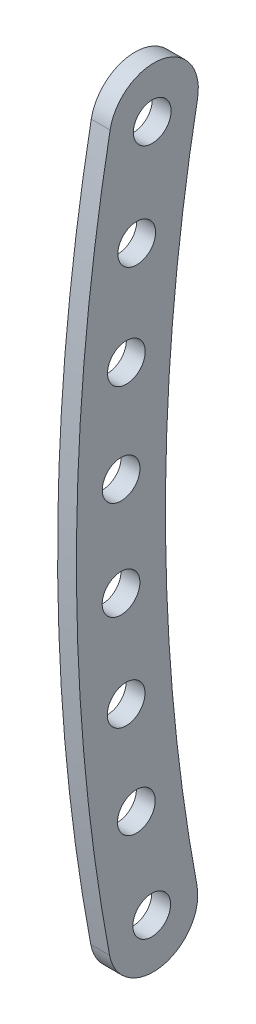
ISO-10303-21;
HEADER;
FILE_DESCRIPTION(('STEP AP214'),'2;1');
FILE_NAME('part.step','',(''),(''),'','','');
FILE_SCHEMA(('AUTOMOTIVE_DESIGN { 1 0 10303 214 1 1 1 1 }'));
ENDSEC;
DATA;
#1=APPLICATION_CONTEXT('core data for automotive mechanical design processes');
#2=APPLICATION_PROTOCOL_DEFINITION('international standard','automotive_design',2000,#1);
#3=PRODUCT_CONTEXT('',#1,'mechanical');
#4=PRODUCT('Part','Part','',(#3));
#5=PRODUCT_RELATED_PRODUCT_CATEGORY('part','',(#4));
#6=PRODUCT_DEFINITION_FORMATION('','',#4);
#7=PRODUCT_DEFINITION_CONTEXT('part definition',#1,'design');
#8=PRODUCT_DEFINITION('design','',#6,#7);
#9=PRODUCT_DEFINITION_SHAPE('','',#8);
#10=(LENGTH_UNIT() NAMED_UNIT(*) SI_UNIT(.MILLI.,.METRE.));
#11=(NAMED_UNIT(*) PLANE_ANGLE_UNIT() SI_UNIT($,.RADIAN.));
#12=(NAMED_UNIT(*) SI_UNIT($,.STERADIAN.) SOLID_ANGLE_UNIT());
#13=UNCERTAINTY_MEASURE_WITH_UNIT(LENGTH_MEASURE(1.E-05),#10,'distance_accuracy_value','');
#14=(GEOMETRIC_REPRESENTATION_CONTEXT(3) GLOBAL_UNCERTAINTY_ASSIGNED_CONTEXT((#13)) GLOBAL_UNIT_ASSIGNED_CONTEXT((#10,
#11,#12)) REPRESENTATION_CONTEXT('',''));
#15=CARTESIAN_POINT('',(0.,0.,0.));
#16=DIRECTION('',(0.,0.,1.));
#17=DIRECTION('',(1.,0.,0.));
#18=AXIS2_PLACEMENT_3D('',#15,#16,#17);
#19=CARTESIAN_POINT('',(17.,-30.3306700046935,-5.23171985749506));
#20=DIRECTION('',(1.,0.,0.));
#21=DIRECTION('',(0.,0.,-1.));
#22=AXIS2_PLACEMENT_3D('',#19,#20,#21);
#23=CYLINDRICAL_SURFACE('',#22,7.08364162430477);
#24=CARTESIAN_POINT('',(20.,-30.3306700046935,-5.23171985749506));
#25=DIRECTION('',(1.,0.,0.));
#26=DIRECTION('',(0.,0.,-1.));
#27=AXIS2_PLACEMENT_3D('',#24,#25,#26);
#28=CIRCLE('',#27,7.08364162430477);
#29=CARTESIAN_POINT('',(20.,-29.0238301935253,-12.1937704440342));
#30=VERTEX_POINT('',#29);
#31=CARTESIAN_POINT('',(20.,-31.6375098158615,1.73033072904394));
#32=VERTEX_POINT('',#31);
#33=EDGE_CURVE('E123',#30,#32,#28,.F.);
#34=ORIENTED_EDGE('',*,*,#33,.T.);
#35=DIRECTION('',(1.,0.,0.));
#36=VECTOR('',#35,1.);
#37=CARTESIAN_POINT('',(17.,-31.6375098158615,1.73033072904394));
#38=LINE('',#37,#36);
#39=CARTESIAN_POINT('',(17.,-31.6375098158615,1.73033072904394));
#40=VERTEX_POINT('',#39);
#41=EDGE_CURVE('E11',#40,#32,#38,.T.);
#42=ORIENTED_EDGE('',*,*,#41,.F.);
#43=CARTESIAN_POINT('',(17.,-30.3306700046935,-5.23171985749506));
#44=DIRECTION('',(1.,0.,0.));
#45=DIRECTION('',(0.,0.,-1.));
#46=AXIS2_PLACEMENT_3D('',#43,#44,#45);
#47=CIRCLE('',#46,7.08364162430477);
#48=CARTESIAN_POINT('',(17.,-29.0238301935253,-12.1937704440342));
#49=VERTEX_POINT('',#48);
#50=EDGE_CURVE('E53',#49,#40,#47,.F.);
#51=ORIENTED_EDGE('',*,*,#50,.F.);
#52=DIRECTION('',(1.,0.,0.));
#53=VECTOR('',#52,1.);
#54=CARTESIAN_POINT('',(17.,-29.0238301935253,-12.1937704440342));
#55=LINE('',#54,#53);
#56=EDGE_CURVE('E38',#49,#30,#55,.T.);
#57=ORIENTED_EDGE('',*,*,#56,.T.);
#58=EDGE_LOOP('',(#34,#42,#51,#57));
#59=FACE_BOUND('',#58,.T.);
#60=ADVANCED_FACE('F35',(#59),#23,.T.);
#61=CARTESIAN_POINT('',(17.,25.,-300.));
#62=DIRECTION('',(1.,0.,0.));
#63=DIRECTION('',(0.,0.,-1.));
#64=AXIS2_PLACEMENT_3D('',#61,#62,#63);
#65=CYLINDRICAL_SURFACE('',#64,307.);
#66=CARTESIAN_POINT('',(20.,25.,-300.));
#67=DIRECTION('',(1.,0.,0.));
#68=DIRECTION('',(0.,0.,-1.));
#69=AXIS2_PLACEMENT_3D('',#66,#67,#68);
#70=CIRCLE('',#69,307.);
#71=CARTESIAN_POINT('',(20.,82.0977725337093,1.64357173937718));
#72=VERTEX_POINT('',#71);
#73=EDGE_CURVE('E128',#72,#32,#70,.T.);
#74=ORIENTED_EDGE('',*,*,#73,.F.);
#75=DIRECTION('',(1.,0.,0.));
#76=VECTOR('',#75,1.);
#77=CARTESIAN_POINT('',(17.,82.0977725337093,1.64357173937718));
#78=LINE('',#77,#76);
#79=CARTESIAN_POINT('',(17.,82.0977725337093,1.64357173937718));
#80=VERTEX_POINT('',#79);
#81=EDGE_CURVE('E44',#80,#72,#78,.T.);
#82=ORIENTED_EDGE('',*,*,#81,.F.);
#83=CARTESIAN_POINT('',(17.,25.,-300.));
#84=DIRECTION('',(1.,0.,0.));
#85=DIRECTION('',(0.,0.,-1.));
#86=AXIS2_PLACEMENT_3D('',#83,#84,#85);
#87=CIRCLE('',#86,307.);
#88=EDGE_CURVE('E87',#80,#40,#87,.T.);
#89=ORIENTED_EDGE('',*,*,#88,.T.);
#90=ORIENTED_EDGE('',*,*,#41,.T.);
#91=EDGE_LOOP('',(#74,#82,#89,#90));
#92=FACE_BOUND('',#91,.T.);
#93=ADVANCED_FACE('F170',(#92),#65,.T.);
#94=CARTESIAN_POINT('',(17.,80.7803127350941,-5.3164769918181));
#95=DIRECTION('',(1.,0.,0.));
#96=DIRECTION('',(0.,0.,-1.));
#97=AXIS2_PLACEMENT_3D('',#94,#95,#96);
#98=CYLINDRICAL_SURFACE('',#97,7.08364162430471);
#99=CARTESIAN_POINT('',(20.,80.7803127350941,-5.3164769918181));
#100=DIRECTION('',(1.,0.,0.));
#101=DIRECTION('',(0.,0.,-1.));
#102=AXIS2_PLACEMENT_3D('',#99,#100,#101);
#103=CIRCLE('',#102,7.08364162430471);
#104=CARTESIAN_POINT('',(20.,79.4628529364789,-12.2765257230137));
#105=VERTEX_POINT('',#104);
#106=EDGE_CURVE('E91',#72,#105,#103,.F.);
#107=ORIENTED_EDGE('',*,*,#106,.T.);
#108=DIRECTION('',(1.,0.,0.));
#109=VECTOR('',#108,1.);
#110=CARTESIAN_POINT('',(17.,79.4628529364789,-12.2765257230137));
#111=LINE('',#110,#109);
#112=CARTESIAN_POINT('',(17.,79.4628529364789,-12.2765257230137));
#113=VERTEX_POINT('',#112);
#114=EDGE_CURVE('E89',#113,#105,#111,.T.);
#115=ORIENTED_EDGE('',*,*,#114,.F.);
#116=CARTESIAN_POINT('',(17.,80.7803127350941,-5.3164769918181));
#117=DIRECTION('',(1.,0.,0.));
#118=DIRECTION('',(0.,0.,-1.));
#119=AXIS2_PLACEMENT_3D('',#116,#117,#118);
#120=CIRCLE('',#119,7.08364162430471);
#121=EDGE_CURVE('E82',#80,#113,#120,.F.);
#122=ORIENTED_EDGE('',*,*,#121,.F.);
#123=ORIENTED_EDGE('',*,*,#81,.T.);
#124=EDGE_LOOP('',(#107,#115,#122,#123));
#125=FACE_BOUND('',#124,.T.);
#126=ADVANCED_FACE('F90',(#125),#98,.T.);
#127=CARTESIAN_POINT('',(17.,33.0818482487635,-0.108880210026918));
#128=DIRECTION('',(1.,0.,0.));
#129=DIRECTION('',(0.,0.,-1.));
#130=AXIS2_PLACEMENT_3D('',#127,#128,#129);
#131=CYLINDRICAL_SURFACE('',#130,2.99999999999999);
#132=CARTESIAN_POINT('',(17.,33.0818482487635,-0.108880210026918));
#133=DIRECTION('',(1.,0.,0.));
#134=DIRECTION('',(0.,0.,-1.));
#135=AXIS2_PLACEMENT_3D('',#132,#133,#134);
#136=CIRCLE('',#135,2.99999999999999);
#137=CARTESIAN_POINT('',(17.,33.0818482487635,-3.10888021002691));
#138=VERTEX_POINT('',#137);
#139=EDGE_CURVE('E117',#138,#138,#136,.T.);
#140=ORIENTED_EDGE('',*,*,#139,.F.);
#141=EDGE_LOOP('',(#140));
#142=FACE_BOUND('',#141,.T.);
#143=CARTESIAN_POINT('',(20.,33.0818482487635,-0.108880210026918));
#144=DIRECTION('',(1.,0.,0.));
#145=DIRECTION('',(0.,0.,-1.));
#146=AXIS2_PLACEMENT_3D('',#143,#144,#145);
#147=CIRCLE('',#146,2.99999999999999);
#148=CARTESIAN_POINT('',(20.,33.0818482487635,-3.10888021002691));
#149=VERTEX_POINT('',#148);
#150=EDGE_CURVE('E149',#149,#149,#147,.T.);
#151=ORIENTED_EDGE('',*,*,#150,.T.);
#152=EDGE_LOOP('',(#151));
#153=FACE_BOUND('',#152,.T.);
#154=ADVANCED_FACE('F179',(#142,#153),#131,.F.);
#155=CARTESIAN_POINT('',(17.,48.7658608795953,-0.94284182342047));
#156=DIRECTION('',(1.,0.,0.));
#157=DIRECTION('',(0.,0.,-1.));
#158=AXIS2_PLACEMENT_3D('',#155,#156,#157);
#159=CYLINDRICAL_SURFACE('',#158,2.99999999999999);
#160=CARTESIAN_POINT('',(17.,48.7658608795953,-0.94284182342047));
#161=DIRECTION('',(1.,0.,0.));
#162=DIRECTION('',(0.,0.,-1.));
#163=AXIS2_PLACEMENT_3D('',#160,#161,#162);
#164=CIRCLE('',#163,2.99999999999999);
#165=CARTESIAN_POINT('',(17.,48.7658608795953,-3.94284182342046));
#166=VERTEX_POINT('',#165);
#167=EDGE_CURVE('E114',#166,#166,#164,.T.);
#168=ORIENTED_EDGE('',*,*,#167,.F.);
#169=EDGE_LOOP('',(#168));
#170=FACE_BOUND('',#169,.T.);
#171=CARTESIAN_POINT('',(20.,48.7658608795953,-0.94284182342047));
#172=DIRECTION('',(1.,0.,0.));
#173=DIRECTION('',(0.,0.,-1.));
#174=AXIS2_PLACEMENT_3D('',#171,#172,#173);
#175=CIRCLE('',#174,2.99999999999999);
#176=CARTESIAN_POINT('',(20.,48.7658608795953,-3.94284182342046));
#177=VERTEX_POINT('',#176);
#178=EDGE_CURVE('E146',#177,#177,#175,.T.);
#179=ORIENTED_EDGE('',*,*,#178,.T.);
#180=EDGE_LOOP('',(#179));
#181=FACE_BOUND('',#180,.T.);
#182=ADVANCED_FACE('F214',(#170,#181),#159,.F.);
#183=CARTESIAN_POINT('',(17.,64.3847329377008,-2.59649832016773));
#184=DIRECTION('',(1.,0.,0.));
#185=DIRECTION('',(0.,0.,-1.));
#186=AXIS2_PLACEMENT_3D('',#183,#184,#185);
#187=CYLINDRICAL_SURFACE('',#186,2.99999999999999);
#188=CARTESIAN_POINT('',(17.,64.3847329377008,-2.59649832016773));
#189=DIRECTION('',(1.,0.,0.));
#190=DIRECTION('',(0.,0.,-1.));
#191=AXIS2_PLACEMENT_3D('',#188,#189,#190);
#192=CIRCLE('',#191,2.99999999999999);
#193=CARTESIAN_POINT('',(17.,64.3847329377008,-5.59649832016772));
#194=VERTEX_POINT('',#193);
#195=EDGE_CURVE('E111',#194,#194,#192,.T.);
#196=ORIENTED_EDGE('',*,*,#195,.F.);
#197=EDGE_LOOP('',(#196));
#198=FACE_BOUND('',#197,.T.);
#199=CARTESIAN_POINT('',(20.,64.3847329377008,-2.59649832016773));
#200=DIRECTION('',(1.,0.,0.));
#201=DIRECTION('',(0.,0.,-1.));
#202=AXIS2_PLACEMENT_3D('',#199,#200,#201);
#203=CIRCLE('',#202,2.99999999999999);
#204=CARTESIAN_POINT('',(20.,64.3847329377008,-5.59649832016772));
#205=VERTEX_POINT('',#204);
#206=EDGE_CURVE('E143',#205,#205,#203,.T.);
#207=ORIENTED_EDGE('',*,*,#206,.T.);
#208=EDGE_LOOP('',(#207));
#209=FACE_BOUND('',#208,.T.);
#210=ADVANCED_FACE('F220',(#198,#209),#187,.F.);
#211=CARTESIAN_POINT('',(17.,-29.4456293027419,-4.9819099617306));
#212=DIRECTION('',(1.,0.,0.));
#213=DIRECTION('',(0.,0.,-1.));
#214=AXIS2_PLACEMENT_3D('',#211,#212,#213);
#215=CYLINDRICAL_SURFACE('',#214,2.99999999999999);
#216=CARTESIAN_POINT('',(17.,-29.4456293027419,-4.9819099617306));
#217=DIRECTION('',(1.,0.,0.));
#218=DIRECTION('',(0.,0.,-1.));
#219=AXIS2_PLACEMENT_3D('',#216,#217,#218);
#220=CIRCLE('',#219,2.99999999999999);
#221=CARTESIAN_POINT('',(17.,-29.4456293027419,-7.98190996173059));
#222=VERTEX_POINT('',#221);
#223=EDGE_CURVE('E108',#222,#222,#220,.T.);
#224=ORIENTED_EDGE('',*,*,#223,.F.);
#225=EDGE_LOOP('',(#224));
#226=FACE_BOUND('',#225,.T.);
#227=CARTESIAN_POINT('',(20.,-29.4456293027419,-4.9819099617306));
#228=DIRECTION('',(1.,0.,0.));
#229=DIRECTION('',(0.,0.,-1.));
#230=AXIS2_PLACEMENT_3D('',#227,#228,#229);
#231=CIRCLE('',#230,2.99999999999999);
#232=CARTESIAN_POINT('',(20.,-29.4456293027419,-7.98190996173059));
#233=VERTEX_POINT('',#232);
#234=EDGE_CURVE('E140',#233,#233,#231,.T.);
#235=ORIENTED_EDGE('',*,*,#234,.T.);
#236=EDGE_LOOP('',(#235));
#237=FACE_BOUND('',#236,.T.);
#238=ADVANCED_FACE('F227',(#226,#237),#215,.F.);
#239=CARTESIAN_POINT('',(17.,-13.9309596088973,-2.53675792809227));
#240=DIRECTION('',(1.,0.,0.));
#241=DIRECTION('',(0.,0.,-1.));
#242=AXIS2_PLACEMENT_3D('',#239,#240,#241);
#243=CYLINDRICAL_SURFACE('',#242,2.99999999999999);
#244=CARTESIAN_POINT('',(17.,-13.9309596088973,-2.53675792809227));
#245=DIRECTION('',(1.,0.,0.));
#246=DIRECTION('',(0.,0.,-1.));
#247=AXIS2_PLACEMENT_3D('',#244,#245,#246);
#248=CIRCLE('',#247,2.99999999999999);
#249=CARTESIAN_POINT('',(17.,-13.9309596088973,-5.53675792809226));
#250=VERTEX_POINT('',#249);
#251=EDGE_CURVE('E105',#250,#250,#248,.T.);
#252=ORIENTED_EDGE('',*,*,#251,.F.);
#253=EDGE_LOOP('',(#252));
#254=FACE_BOUND('',#253,.T.);
#255=CARTESIAN_POINT('',(20.,-13.9309596088973,-2.53675792809227));
#256=DIRECTION('',(1.,0.,0.));
#257=DIRECTION('',(0.,0.,-1.));
#258=AXIS2_PLACEMENT_3D('',#255,#256,#257);
#259=CIRCLE('',#258,2.99999999999999);
#260=CARTESIAN_POINT('',(20.,-13.9309596088973,-5.53675792809226));
#261=VERTEX_POINT('',#260);
#262=EDGE_CURVE('E137',#261,#261,#259,.T.);
#263=ORIENTED_EDGE('',*,*,#262,.T.);
#264=EDGE_LOOP('',(#263));
#265=FACE_BOUND('',#264,.T.);
#266=ADVANCED_FACE('F195',(#254,#265),#243,.F.);
#267=CARTESIAN_POINT('',(17.,1.69041713917734,-0.90693196455649));
#268=DIRECTION('',(1.,0.,0.));
#269=DIRECTION('',(0.,0.,-1.));
#270=AXIS2_PLACEMENT_3D('',#267,#268,#269);
#271=CYLINDRICAL_SURFACE('',#270,2.99999999999999);
#272=CARTESIAN_POINT('',(17.,1.69041713917734,-0.90693196455649));
#273=DIRECTION('',(1.,0.,0.));
#274=DIRECTION('',(0.,0.,-1.));
#275=AXIS2_PLACEMENT_3D('',#272,#273,#274);
#276=CIRCLE('',#275,2.99999999999999);
#277=CARTESIAN_POINT('',(17.,1.69041713917734,-3.90693196455648));
#278=VERTEX_POINT('',#277);
#279=EDGE_CURVE('E102',#278,#278,#276,.T.);
#280=ORIENTED_EDGE('',*,*,#279,.F.);
#281=EDGE_LOOP('',(#280));
#282=FACE_BOUND('',#281,.T.);
#283=CARTESIAN_POINT('',(20.,1.69041713917734,-0.90693196455649));
#284=DIRECTION('',(1.,0.,0.));
#285=DIRECTION('',(0.,0.,-1.));
#286=AXIS2_PLACEMENT_3D('',#283,#284,#285);
#287=CIRCLE('',#286,2.99999999999999);
#288=CARTESIAN_POINT('',(20.,1.69041713917734,-3.90693196455648));
#289=VERTEX_POINT('',#288);
#290=EDGE_CURVE('E134',#289,#289,#287,.T.);
#291=ORIENTED_EDGE('',*,*,#290,.T.);
#292=EDGE_LOOP('',(#291));
#293=FACE_BOUND('',#292,.T.);
#294=ADVANCED_FACE('F190',(#282,#293),#271,.F.);
#295=CARTESIAN_POINT('',(17.,17.3756838336443,-0.0968993108016458));
#296=DIRECTION('',(1.,0.,0.));
#297=DIRECTION('',(0.,0.,-1.));
#298=AXIS2_PLACEMENT_3D('',#295,#296,#297);
#299=CYLINDRICAL_SURFACE('',#298,2.99999999999999);
#300=CARTESIAN_POINT('',(17.,17.3756838336443,-0.0968993108016458));
#301=DIRECTION('',(1.,0.,0.));
#302=DIRECTION('',(0.,0.,-1.));
#303=AXIS2_PLACEMENT_3D('',#300,#301,#302);
#304=CIRCLE('',#303,2.99999999999999);
#305=CARTESIAN_POINT('',(17.,17.3756838336443,-3.09689931080164));
#306=VERTEX_POINT('',#305);
#307=EDGE_CURVE('E99',#306,#306,#304,.T.);
#308=ORIENTED_EDGE('',*,*,#307,.F.);
#309=EDGE_LOOP('',(#308));
#310=FACE_BOUND('',#309,.T.);
#311=CARTESIAN_POINT('',(20.,17.3756838336443,-0.0968993108016458));
#312=DIRECTION('',(1.,0.,0.));
#313=DIRECTION('',(0.,0.,-1.));
#314=AXIS2_PLACEMENT_3D('',#311,#312,#313);
#315=CIRCLE('',#314,2.99999999999999);
#316=CARTESIAN_POINT('',(20.,17.3756838336443,-3.09689931080164));
#317=VERTEX_POINT('',#316);
#318=EDGE_CURVE('E131',#317,#317,#315,.T.);
#319=ORIENTED_EDGE('',*,*,#318,.T.);
#320=EDGE_LOOP('',(#319));
#321=FACE_BOUND('',#320,.T.);
#322=ADVANCED_FACE('F182',(#310,#321),#299,.F.);
#323=CARTESIAN_POINT('',(17.,25.,-300.));
#324=DIRECTION('',(1.,0.,0.));
#325=DIRECTION('',(0.,0.,-1.));
#326=AXIS2_PLACEMENT_3D('',#323,#324,#325);
#327=CYLINDRICAL_SURFACE('',#326,292.832716751391);
#328=CARTESIAN_POINT('',(20.,25.,-300.));
#329=DIRECTION('',(1.,0.,0.));
#330=DIRECTION('',(0.,0.,-1.));
#331=AXIS2_PLACEMENT_3D('',#328,#329,#330);
#332=CIRCLE('',#331,292.832716751391);
#333=EDGE_CURVE('E125',#30,#105,#332,.F.);
#334=ORIENTED_EDGE('',*,*,#333,.F.);
#335=ORIENTED_EDGE('',*,*,#56,.F.);
#336=CARTESIAN_POINT('',(17.,25.,-300.));
#337=DIRECTION('',(1.,0.,0.));
#338=DIRECTION('',(0.,0.,-1.));
#339=AXIS2_PLACEMENT_3D('',#336,#337,#338);
#340=CIRCLE('',#339,292.832716751391);
#341=EDGE_CURVE('E86',#49,#113,#340,.F.);
#342=ORIENTED_EDGE('',*,*,#341,.T.);
#343=ORIENTED_EDGE('',*,*,#114,.T.);
#344=EDGE_LOOP('',(#334,#335,#342,#343));
#345=FACE_BOUND('',#344,.T.);
#346=ADVANCED_FACE('F93',(#345),#327,.F.);
#347=CARTESIAN_POINT('',(17.,79.8956541804235,-5.0653171427555));
#348=DIRECTION('',(1.,0.,0.));
#349=DIRECTION('',(0.,0.,-1.));
#350=AXIS2_PLACEMENT_3D('',#347,#348,#349);
#351=CYLINDRICAL_SURFACE('',#350,2.99999999999986);
#352=CARTESIAN_POINT('',(17.,79.8956541804235,-5.0653171427555));
#353=DIRECTION('',(1.,0.,0.));
#354=DIRECTION('',(0.,0.,-1.));
#355=AXIS2_PLACEMENT_3D('',#352,#353,#354);
#356=CIRCLE('',#355,2.99999999999986);
#357=CARTESIAN_POINT('',(17.,79.8956541804235,-8.06531714275535));
#358=VERTEX_POINT('',#357);
#359=EDGE_CURVE('E120',#358,#358,#356,.T.);
#360=ORIENTED_EDGE('',*,*,#359,.F.);
#361=EDGE_LOOP('',(#360));
#362=FACE_BOUND('',#361,.T.);
#363=CARTESIAN_POINT('',(20.,79.8956541804235,-5.0653171427555));
#364=DIRECTION('',(1.,0.,0.));
#365=DIRECTION('',(0.,0.,-1.));
#366=AXIS2_PLACEMENT_3D('',#363,#364,#365);
#367=CIRCLE('',#366,2.99999999999986);
#368=CARTESIAN_POINT('',(20.,79.8956541804235,-8.06531714275535));
#369=VERTEX_POINT('',#368);
#370=EDGE_CURVE('E95',#369,#369,#367,.T.);
#371=ORIENTED_EDGE('',*,*,#370,.T.);
#372=EDGE_LOOP('',(#371));
#373=FACE_BOUND('',#372,.T.);
#374=ADVANCED_FACE('F156',(#362,#373),#351,.F.);
#375=CARTESIAN_POINT('',(17.,0.,0.));
#376=DIRECTION('',(1.,0.,0.));
#377=DIRECTION('',(0.,0.,-1.));
#378=AXIS2_PLACEMENT_3D('',#375,#376,#377);
#379=PLANE('',#378);
#380=ORIENTED_EDGE('',*,*,#50,.T.);
#381=ORIENTED_EDGE('',*,*,#88,.F.);
#382=ORIENTED_EDGE('',*,*,#121,.T.);
#383=ORIENTED_EDGE('',*,*,#341,.F.);
#384=EDGE_LOOP('',(#380,#381,#382,#383));
#385=FACE_BOUND('',#384,.T.);
#386=ORIENTED_EDGE('',*,*,#307,.T.);
#387=EDGE_LOOP('',(#386));
#388=FACE_BOUND('',#387,.T.);
#389=ORIENTED_EDGE('',*,*,#279,.T.);
#390=EDGE_LOOP('',(#389));
#391=FACE_BOUND('',#390,.T.);
#392=ORIENTED_EDGE('',*,*,#251,.T.);
#393=EDGE_LOOP('',(#392));
#394=FACE_BOUND('',#393,.T.);
#395=ORIENTED_EDGE('',*,*,#223,.T.);
#396=EDGE_LOOP('',(#395));
#397=FACE_BOUND('',#396,.T.);
#398=ORIENTED_EDGE('',*,*,#195,.T.);
#399=EDGE_LOOP('',(#398));
#400=FACE_BOUND('',#399,.T.);
#401=ORIENTED_EDGE('',*,*,#167,.T.);
#402=EDGE_LOOP('',(#401));
#403=FACE_BOUND('',#402,.T.);
#404=ORIENTED_EDGE('',*,*,#139,.T.);
#405=EDGE_LOOP('',(#404));
#406=FACE_BOUND('',#405,.T.);
#407=ORIENTED_EDGE('',*,*,#359,.T.);
#408=EDGE_LOOP('',(#407));
#409=FACE_BOUND('',#408,.T.);
#410=ADVANCED_FACE('F84',(#385,#388,#391,#394,#397,#400,#403,#406,#409),#379,.F.);
#411=CARTESIAN_POINT('',(20.,0.,0.));
#412=DIRECTION('',(1.,0.,0.));
#413=DIRECTION('',(0.,0.,-1.));
#414=AXIS2_PLACEMENT_3D('',#411,#412,#413);
#415=PLANE('',#414);
#416=ORIENTED_EDGE('',*,*,#33,.F.);
#417=ORIENTED_EDGE('',*,*,#333,.T.);
#418=ORIENTED_EDGE('',*,*,#106,.F.);
#419=ORIENTED_EDGE('',*,*,#73,.T.);
#420=EDGE_LOOP('',(#416,#417,#418,#419));
#421=FACE_BOUND('',#420,.T.);
#422=ORIENTED_EDGE('',*,*,#318,.F.);
#423=EDGE_LOOP('',(#422));
#424=FACE_BOUND('',#423,.T.);
#425=ORIENTED_EDGE('',*,*,#290,.F.);
#426=EDGE_LOOP('',(#425));
#427=FACE_BOUND('',#426,.T.);
#428=ORIENTED_EDGE('',*,*,#262,.F.);
#429=EDGE_LOOP('',(#428));
#430=FACE_BOUND('',#429,.T.);
#431=ORIENTED_EDGE('',*,*,#234,.F.);
#432=EDGE_LOOP('',(#431));
#433=FACE_BOUND('',#432,.T.);
#434=ORIENTED_EDGE('',*,*,#206,.F.);
#435=EDGE_LOOP('',(#434));
#436=FACE_BOUND('',#435,.T.);
#437=ORIENTED_EDGE('',*,*,#178,.F.);
#438=EDGE_LOOP('',(#437));
#439=FACE_BOUND('',#438,.T.);
#440=ORIENTED_EDGE('',*,*,#150,.F.);
#441=EDGE_LOOP('',(#440));
#442=FACE_BOUND('',#441,.T.);
#443=ORIENTED_EDGE('',*,*,#370,.F.);
#444=EDGE_LOOP('',(#443));
#445=FACE_BOUND('',#444,.T.);
#446=ADVANCED_FACE('F158',(#421,#424,#427,#430,#433,#436,#439,#442,#445),#415,.T.);
#447=CLOSED_SHELL('',(#60,#93,#126,#154,#182,#210,#238,#266,#294,#322,#346,#374,#410,#446));
#448=MANIFOLD_SOLID_BREP('B2',#447);
#449=ADVANCED_BREP_SHAPE_REPRESENTATION('',(#18,#448),#14);
#450=SHAPE_DEFINITION_REPRESENTATION(#9,#449);
ENDSEC;
END-ISO-10303-21;
